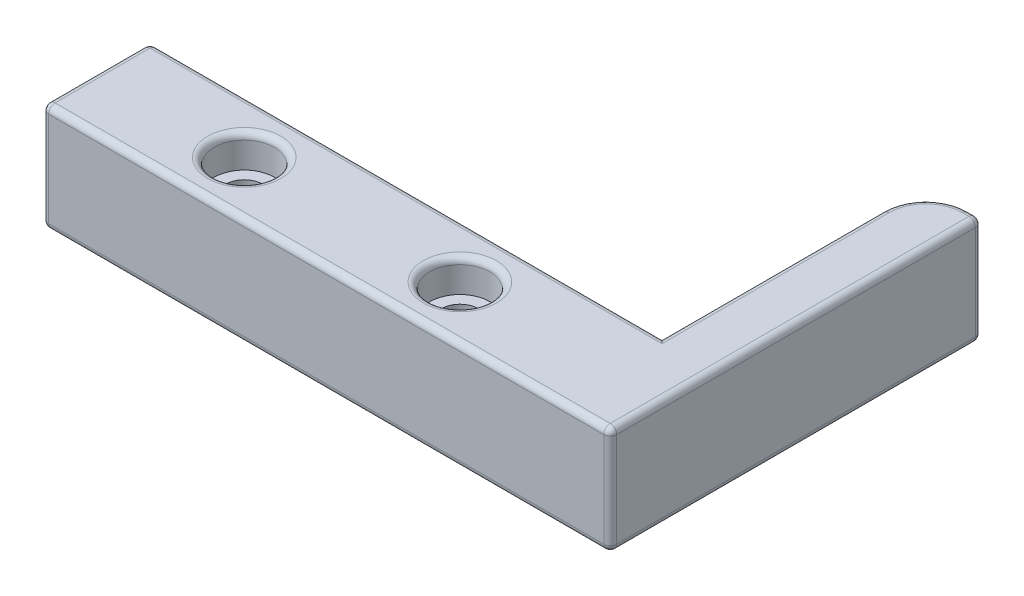
ISO-10303-21;
HEADER;
FILE_DESCRIPTION(('STEP AP214'),'2;1');
FILE_NAME('part.step','',(''),(''),'','','');
FILE_SCHEMA(('AUTOMOTIVE_DESIGN { 1 0 10303 214 1 1 1 1 }'));
ENDSEC;
DATA;
#1=APPLICATION_CONTEXT('core data for automotive mechanical design processes');
#2=APPLICATION_PROTOCOL_DEFINITION('international standard','automotive_design',2000,#1);
#3=PRODUCT_CONTEXT('',#1,'mechanical');
#4=PRODUCT('Part','Part','',(#3));
#5=PRODUCT_RELATED_PRODUCT_CATEGORY('part','',(#4));
#6=PRODUCT_DEFINITION_FORMATION('','',#4);
#7=PRODUCT_DEFINITION_CONTEXT('part definition',#1,'design');
#8=PRODUCT_DEFINITION('design','',#6,#7);
#9=PRODUCT_DEFINITION_SHAPE('','',#8);
#10=(LENGTH_UNIT() NAMED_UNIT(*) SI_UNIT(.MILLI.,.METRE.));
#11=(NAMED_UNIT(*) PLANE_ANGLE_UNIT() SI_UNIT($,.RADIAN.));
#12=(NAMED_UNIT(*) SI_UNIT($,.STERADIAN.) SOLID_ANGLE_UNIT());
#13=UNCERTAINTY_MEASURE_WITH_UNIT(LENGTH_MEASURE(1.E-05),#10,'distance_accuracy_value','');
#14=(GEOMETRIC_REPRESENTATION_CONTEXT(3) GLOBAL_UNCERTAINTY_ASSIGNED_CONTEXT((#13)) GLOBAL_UNIT_ASSIGNED_CONTEXT((#10,
#11,#12)) REPRESENTATION_CONTEXT('',''));
#15=CARTESIAN_POINT('',(0.,0.,0.));
#16=DIRECTION('',(0.,0.,1.));
#17=DIRECTION('',(1.,0.,0.));
#18=AXIS2_PLACEMENT_3D('',#15,#16,#17);
#19=CARTESIAN_POINT('',(42.8625,12.7,-6.35));
#20=DIRECTION('',(0.,-1.,0.));
#21=DIRECTION('',(0.,0.,-1.));
#22=AXIS2_PLACEMENT_3D('',#19,#20,#21);
#23=CYLINDRICAL_SURFACE('',#22,2.159);
#24=CARTESIAN_POINT('',(42.8625,0.,-6.35));
#25=DIRECTION('',(0.,1.,0.));
#26=DIRECTION('',(0.,0.,1.));
#27=AXIS2_PLACEMENT_3D('',#24,#25,#26);
#28=CIRCLE('',#27,2.159);
#29=CARTESIAN_POINT('',(42.8625,0.,-4.191));
#30=VERTEX_POINT('',#29);
#31=EDGE_CURVE('E200',#30,#30,#28,.T.);
#32=ORIENTED_EDGE('',*,*,#31,.F.);
#33=EDGE_LOOP('',(#32));
#34=FACE_BOUND('',#33,.T.);
#35=CARTESIAN_POINT('',(42.8625,8.89,-6.35));
#36=DIRECTION('',(0.,1.,0.));
#37=DIRECTION('',(0.,0.,1.));
#38=AXIS2_PLACEMENT_3D('',#35,#36,#37);
#39=CIRCLE('',#38,2.159);
#40=CARTESIAN_POINT('',(42.8625,8.89,-4.191));
#41=VERTEX_POINT('',#40);
#42=EDGE_CURVE('E203',#41,#41,#39,.T.);
#43=ORIENTED_EDGE('',*,*,#42,.T.);
#44=EDGE_LOOP('',(#43));
#45=FACE_BOUND('',#44,.T.);
#46=ADVANCED_FACE('F33',(#34,#45),#23,.F.);
#47=CARTESIAN_POINT('',(17.4625,12.7,-6.35));
#48=DIRECTION('',(0.,-1.,0.));
#49=DIRECTION('',(0.,0.,-1.));
#50=AXIS2_PLACEMENT_3D('',#47,#48,#49);
#51=CYLINDRICAL_SURFACE('',#50,2.159);
#52=CARTESIAN_POINT('',(17.4625,0.,-6.35));
#53=DIRECTION('',(0.,1.,0.));
#54=DIRECTION('',(0.,0.,1.));
#55=AXIS2_PLACEMENT_3D('',#52,#53,#54);
#56=CIRCLE('',#55,2.159);
#57=CARTESIAN_POINT('',(17.4625,0.,-4.191));
#58=VERTEX_POINT('',#57);
#59=EDGE_CURVE('E371',#58,#58,#56,.T.);
#60=ORIENTED_EDGE('',*,*,#59,.F.);
#61=EDGE_LOOP('',(#60));
#62=FACE_BOUND('',#61,.T.);
#63=CARTESIAN_POINT('',(17.4625,8.89,-6.35));
#64=DIRECTION('',(0.,1.,0.));
#65=DIRECTION('',(0.,0.,1.));
#66=AXIS2_PLACEMENT_3D('',#63,#64,#65);
#67=CIRCLE('',#66,2.159);
#68=CARTESIAN_POINT('',(17.4625,8.89,-4.191));
#69=VERTEX_POINT('',#68);
#70=EDGE_CURVE('E368',#69,#69,#67,.T.);
#71=ORIENTED_EDGE('',*,*,#70,.T.);
#72=EDGE_LOOP('',(#71));
#73=FACE_BOUND('',#72,.T.);
#74=ADVANCED_FACE('F400',(#62,#73),#51,.F.);
#75=CARTESIAN_POINT('',(0.,12.7,0.));
#76=DIRECTION('',(0.,1.,0.));
#77=DIRECTION('',(0.,0.,1.));
#78=AXIS2_PLACEMENT_3D('',#75,#76,#77);
#79=PLANE('',#78);
#80=CARTESIAN_POINT('',(17.4625,12.7,-6.35));
#81=DIRECTION('',(0.,1.,0.));
#82=DIRECTION('',(0.,0.,1.));
#83=AXIS2_PLACEMENT_3D('',#80,#81,#82);
#84=CIRCLE('',#83,4.318);
#85=CARTESIAN_POINT('',(17.4625,12.7,-2.032));
#86=VERTEX_POINT('',#85);
#87=EDGE_CURVE('E238',#86,#86,#84,.F.);
#88=ORIENTED_EDGE('',*,*,#87,.T.);
#89=EDGE_LOOP('',(#88));
#90=FACE_BOUND('',#89,.T.);
#91=CARTESIAN_POINT('',(42.8625,12.7,-6.35));
#92=DIRECTION('',(0.,1.,0.));
#93=DIRECTION('',(0.,0.,1.));
#94=AXIS2_PLACEMENT_3D('',#91,#92,#93);
#95=CIRCLE('',#94,4.31800000000001);
#96=CARTESIAN_POINT('',(42.8625,12.7,-2.03199999999999));
#97=VERTEX_POINT('',#96);
#98=EDGE_CURVE('E235',#97,#97,#95,.F.);
#99=ORIENTED_EDGE('',*,*,#98,.T.);
#100=EDGE_LOOP('',(#99));
#101=FACE_BOUND('',#100,.T.);
#102=DIRECTION('',(-1.,0.,0.));
#103=VECTOR('',#102,1.);
#104=CARTESIAN_POINT('',(0.,12.7,-11.938));
#105=LINE('',#104,#103);
#106=CARTESIAN_POINT('',(61.087,12.7,-11.938));
#107=VERTEX_POINT('',#106);
#108=CARTESIAN_POINT('',(0.762000000000001,12.7,-11.938));
#109=VERTEX_POINT('',#108);
#110=EDGE_CURVE('E222',#107,#109,#105,.T.);
#111=ORIENTED_EDGE('',*,*,#110,.T.);
#112=DIRECTION('',(0.,0.,1.));
#113=VECTOR('',#112,1.);
#114=CARTESIAN_POINT('',(0.762,12.7,0.));
#115=LINE('',#114,#113);
#116=CARTESIAN_POINT('',(0.762,12.7,-0.762));
#117=VERTEX_POINT('',#116);
#118=EDGE_CURVE('E233',#109,#117,#115,.T.);
#119=ORIENTED_EDGE('',*,*,#118,.T.);
#120=DIRECTION('',(1.,0.,0.));
#121=VECTOR('',#120,1.);
#122=CARTESIAN_POINT('',(66.929,12.7,-0.761999999999999));
#123=LINE('',#122,#121);
#124=CARTESIAN_POINT('',(66.167,12.7,-0.761999999999999));
#125=VERTEX_POINT('',#124);
#126=EDGE_CURVE('E231',#117,#125,#123,.T.);
#127=ORIENTED_EDGE('',*,*,#126,.T.);
#128=DIRECTION('',(0.,0.,1.));
#129=VECTOR('',#128,1.);
#130=CARTESIAN_POINT('',(66.167,12.7,0.));
#131=LINE('',#130,#129);
#132=CARTESIAN_POINT('',(66.167,12.7,-43.0132593089877));
#133=VERTEX_POINT('',#132);
#134=EDGE_CURVE('E229',#125,#133,#131,.F.);
#135=ORIENTED_EDGE('',*,*,#134,.T.);
#136=DIRECTION('',(-1.,0.,0.));
#137=VECTOR('',#136,1.);
#138=CARTESIAN_POINT('',(65.405,12.7,-43.0132593089877));
#139=LINE('',#138,#137);
#140=CARTESIAN_POINT('',(65.405,12.7,-43.0132593089877));
#141=VERTEX_POINT('',#140);
#142=EDGE_CURVE('E226',#133,#141,#139,.T.);
#143=ORIENTED_EDGE('',*,*,#142,.T.);
#144=CARTESIAN_POINT('',(65.405,12.7,-38.6952593089877));
#145=DIRECTION('',(0.,1.,0.));
#146=DIRECTION('',(0.,0.,1.));
#147=AXIS2_PLACEMENT_3D('',#144,#145,#146);
#148=CIRCLE('',#147,4.318);
#149=CARTESIAN_POINT('',(61.087,12.7,-38.6952593089877));
#150=VERTEX_POINT('',#149);
#151=EDGE_CURVE('E224',#141,#150,#148,.T.);
#152=ORIENTED_EDGE('',*,*,#151,.T.);
#153=DIRECTION('',(0.,0.,1.));
#154=VECTOR('',#153,1.);
#155=CARTESIAN_POINT('',(61.087,12.7,-12.7));
#156=LINE('',#155,#154);
#157=EDGE_CURVE('E179',#150,#107,#156,.T.);
#158=ORIENTED_EDGE('',*,*,#157,.T.);
#159=EDGE_LOOP('',(#111,#119,#127,#135,#143,#152,#158));
#160=FACE_BOUND('',#159,.T.);
#161=ADVANCED_FACE('F406',(#90,#101,#160),#79,.T.);
#162=CARTESIAN_POINT('',(0.,0.,0.));
#163=DIRECTION('',(0.,1.,0.));
#164=DIRECTION('',(0.,0.,1.));
#165=AXIS2_PLACEMENT_3D('',#162,#163,#164);
#166=PLANE('',#165);
#167=DIRECTION('',(-1.,0.,0.));
#168=VECTOR('',#167,1.);
#169=CARTESIAN_POINT('',(0.,0.,-11.938));
#170=LINE('',#169,#168);
#171=CARTESIAN_POINT('',(0.762000000000001,0.,-11.938));
#172=VERTEX_POINT('',#171);
#173=CARTESIAN_POINT('',(61.087,0.,-11.938));
#174=VERTEX_POINT('',#173);
#175=EDGE_CURVE('E214',#172,#174,#170,.F.);
#176=ORIENTED_EDGE('',*,*,#175,.T.);
#177=DIRECTION('',(0.,0.,-1.));
#178=VECTOR('',#177,1.);
#179=CARTESIAN_POINT('',(61.087,0.,0.));
#180=LINE('',#179,#178);
#181=CARTESIAN_POINT('',(61.087,0.,-38.6952593089877));
#182=VERTEX_POINT('',#181);
#183=EDGE_CURVE('E218',#174,#182,#180,.T.);
#184=ORIENTED_EDGE('',*,*,#183,.T.);
#185=CARTESIAN_POINT('',(65.405,0.,-38.6952593089877));
#186=DIRECTION('',(0.,1.,0.));
#187=DIRECTION('',(0.,0.,1.));
#188=AXIS2_PLACEMENT_3D('',#185,#186,#187);
#189=CIRCLE('',#188,4.318);
#190=CARTESIAN_POINT('',(65.405,0.,-43.0132593089877));
#191=VERTEX_POINT('',#190);
#192=EDGE_CURVE('E216',#182,#191,#189,.F.);
#193=ORIENTED_EDGE('',*,*,#192,.T.);
#194=DIRECTION('',(-1.,0.,0.));
#195=VECTOR('',#194,1.);
#196=CARTESIAN_POINT('',(0.,0.,-43.0132593089877));
#197=LINE('',#196,#195);
#198=CARTESIAN_POINT('',(66.167,0.,-43.0132593089877));
#199=VERTEX_POINT('',#198);
#200=EDGE_CURVE('E165',#191,#199,#197,.F.);
#201=ORIENTED_EDGE('',*,*,#200,.T.);
#202=DIRECTION('',(0.,0.,-1.));
#203=VECTOR('',#202,1.);
#204=CARTESIAN_POINT('',(66.167,0.,0.));
#205=LINE('',#204,#203);
#206=CARTESIAN_POINT('',(66.167,0.,-0.761999999999999));
#207=VERTEX_POINT('',#206);
#208=EDGE_CURVE('E209',#199,#207,#205,.F.);
#209=ORIENTED_EDGE('',*,*,#208,.T.);
#210=DIRECTION('',(1.,0.,0.));
#211=VECTOR('',#210,1.);
#212=CARTESIAN_POINT('',(0.,0.,-0.762));
#213=LINE('',#212,#211);
#214=CARTESIAN_POINT('',(0.762,0.,-0.762));
#215=VERTEX_POINT('',#214);
#216=EDGE_CURVE('E190',#207,#215,#213,.F.);
#217=ORIENTED_EDGE('',*,*,#216,.T.);
#218=DIRECTION('',(0.,0.,1.));
#219=VECTOR('',#218,1.);
#220=CARTESIAN_POINT('',(0.762,0.,0.));
#221=LINE('',#220,#219);
#222=EDGE_CURVE('E211',#215,#172,#221,.F.);
#223=ORIENTED_EDGE('',*,*,#222,.T.);
#224=EDGE_LOOP('',(#176,#184,#193,#201,#209,#217,#223));
#225=FACE_BOUND('',#224,.T.);
#226=ORIENTED_EDGE('',*,*,#31,.T.);
#227=EDGE_LOOP('',(#226));
#228=FACE_BOUND('',#227,.T.);
#229=ORIENTED_EDGE('',*,*,#59,.T.);
#230=EDGE_LOOP('',(#229));
#231=FACE_BOUND('',#230,.T.);
#232=ADVANCED_FACE('F414',(#225,#228,#231),#166,.F.);
#233=CARTESIAN_POINT('',(0.,12.7,-12.7));
#234=DIRECTION('',(1.,0.,0.));
#235=DIRECTION('',(0.,0.,-1.));
#236=AXIS2_PLACEMENT_3D('',#233,#234,#235);
#237=PLANE('',#236);
#238=DIRECTION('',(0.,-1.,0.));
#239=VECTOR('',#238,1.);
#240=CARTESIAN_POINT('',(0.,12.7,-11.938));
#241=LINE('',#240,#239);
#242=CARTESIAN_POINT('',(0.,11.938,-11.938));
#243=VERTEX_POINT('',#242);
#244=CARTESIAN_POINT('',(0.,0.762000000000001,-11.938));
#245=VERTEX_POINT('',#244);
#246=EDGE_CURVE('E258',#243,#245,#241,.T.);
#247=ORIENTED_EDGE('',*,*,#246,.T.);
#248=DIRECTION('',(0.,0.,1.));
#249=VECTOR('',#248,1.);
#250=CARTESIAN_POINT('',(0.,0.762000000000001,-12.7));
#251=LINE('',#250,#249);
#252=CARTESIAN_POINT('',(0.,0.762000000000001,-0.762));
#253=VERTEX_POINT('',#252);
#254=EDGE_CURVE('E262',#245,#253,#251,.T.);
#255=ORIENTED_EDGE('',*,*,#254,.T.);
#256=DIRECTION('',(0.,-1.,0.));
#257=VECTOR('',#256,1.);
#258=CARTESIAN_POINT('',(0.,12.7,-0.762000000000001));
#259=LINE('',#258,#257);
#260=CARTESIAN_POINT('',(0.,11.938,-0.762));
#261=VERTEX_POINT('',#260);
#262=EDGE_CURVE('E260',#253,#261,#259,.F.);
#263=ORIENTED_EDGE('',*,*,#262,.T.);
#264=DIRECTION('',(0.,0.,1.));
#265=VECTOR('',#264,1.);
#266=CARTESIAN_POINT('',(0.,11.938,-12.7));
#267=LINE('',#266,#265);
#268=EDGE_CURVE('E256',#261,#243,#267,.F.);
#269=ORIENTED_EDGE('',*,*,#268,.T.);
#270=EDGE_LOOP('',(#247,#255,#263,#269));
#271=FACE_BOUND('',#270,.T.);
#272=ADVANCED_FACE('F418',(#271),#237,.F.);
#273=CARTESIAN_POINT('',(0.,12.7,0.));
#274=DIRECTION('',(0.,0.,-1.));
#275=DIRECTION('',(-1.,0.,0.));
#276=AXIS2_PLACEMENT_3D('',#273,#274,#275);
#277=PLANE('',#276);
#278=DIRECTION('',(0.,-1.,0.));
#279=VECTOR('',#278,1.);
#280=CARTESIAN_POINT('',(0.762,12.7,0.));
#281=LINE('',#280,#279);
#282=CARTESIAN_POINT('',(0.762,11.938,0.));
#283=VERTEX_POINT('',#282);
#284=CARTESIAN_POINT('',(0.762,0.762000000000001,0.));
#285=VERTEX_POINT('',#284);
#286=EDGE_CURVE('E42',#283,#285,#281,.T.);
#287=ORIENTED_EDGE('',*,*,#286,.T.);
#288=DIRECTION('',(1.,0.,0.));
#289=VECTOR('',#288,1.);
#290=CARTESIAN_POINT('',(0.,0.762000000000001,0.));
#291=LINE('',#290,#289);
#292=CARTESIAN_POINT('',(66.167,0.762000000000001,0.));
#293=VERTEX_POINT('',#292);
#294=EDGE_CURVE('E11',#285,#293,#291,.T.);
#295=ORIENTED_EDGE('',*,*,#294,.T.);
#296=DIRECTION('',(0.,-1.,0.));
#297=VECTOR('',#296,1.);
#298=CARTESIAN_POINT('',(66.167,12.7,0.));
#299=LINE('',#298,#297);
#300=CARTESIAN_POINT('',(66.167,11.938,0.));
#301=VERTEX_POINT('',#300);
#302=EDGE_CURVE('E275',#293,#301,#299,.F.);
#303=ORIENTED_EDGE('',*,*,#302,.T.);
#304=DIRECTION('',(1.,0.,0.));
#305=VECTOR('',#304,1.);
#306=CARTESIAN_POINT('',(0.,11.938,0.));
#307=LINE('',#306,#305);
#308=EDGE_CURVE('E53',#301,#283,#307,.F.);
#309=ORIENTED_EDGE('',*,*,#308,.T.);
#310=EDGE_LOOP('',(#287,#295,#303,#309));
#311=FACE_BOUND('',#310,.T.);
#312=ADVANCED_FACE('F423',(#311),#277,.F.);
#313=CARTESIAN_POINT('',(0.,12.7,-12.7));
#314=DIRECTION('',(0.,0.,1.));
#315=DIRECTION('',(1.,0.,0.));
#316=AXIS2_PLACEMENT_3D('',#313,#314,#315);
#317=PLANE('',#316);
#318=DIRECTION('',(0.,-1.,0.));
#319=VECTOR('',#318,1.);
#320=CARTESIAN_POINT('',(60.325,12.7,-12.7));
#321=LINE('',#320,#319);
#322=CARTESIAN_POINT('',(60.325,11.938,-12.7));
#323=VERTEX_POINT('',#322);
#324=CARTESIAN_POINT('',(60.325,0.762000000000001,-12.7));
#325=VERTEX_POINT('',#324);
#326=EDGE_CURVE('E196',#323,#325,#321,.T.);
#327=ORIENTED_EDGE('',*,*,#326,.T.);
#328=DIRECTION('',(-1.,0.,0.));
#329=VECTOR('',#328,1.);
#330=CARTESIAN_POINT('',(0.,0.762000000000001,-12.7));
#331=LINE('',#330,#329);
#332=CARTESIAN_POINT('',(0.762000000000001,0.762000000000001,-12.7));
#333=VERTEX_POINT('',#332);
#334=EDGE_CURVE('E269',#325,#333,#331,.T.);
#335=ORIENTED_EDGE('',*,*,#334,.T.);
#336=DIRECTION('',(0.,-1.,0.));
#337=VECTOR('',#336,1.);
#338=CARTESIAN_POINT('',(0.762000000000001,12.7,-12.7));
#339=LINE('',#338,#337);
#340=CARTESIAN_POINT('',(0.762000000000001,11.938,-12.7));
#341=VERTEX_POINT('',#340);
#342=EDGE_CURVE('E267',#333,#341,#339,.F.);
#343=ORIENTED_EDGE('',*,*,#342,.T.);
#344=DIRECTION('',(-1.,0.,0.));
#345=VECTOR('',#344,1.);
#346=CARTESIAN_POINT('',(60.325,11.938,-12.7));
#347=LINE('',#346,#345);
#348=EDGE_CURVE('E265',#341,#323,#347,.F.);
#349=ORIENTED_EDGE('',*,*,#348,.T.);
#350=EDGE_LOOP('',(#327,#335,#343,#349));
#351=FACE_BOUND('',#350,.T.);
#352=ADVANCED_FACE('F420',(#351),#317,.F.);
#353=CARTESIAN_POINT('',(66.929,12.7,-43.7752593089877));
#354=DIRECTION('',(0.,0.,1.));
#355=DIRECTION('',(1.,0.,0.));
#356=AXIS2_PLACEMENT_3D('',#353,#354,#355);
#357=PLANE('',#356);
#358=DIRECTION('',(0.,1.,0.));
#359=VECTOR('',#358,1.);
#360=CARTESIAN_POINT('',(66.167,0.,-43.7752593089877));
#361=LINE('',#360,#359);
#362=CARTESIAN_POINT('',(66.167,11.938,-43.7752593089877));
#363=VERTEX_POINT('',#362);
#364=CARTESIAN_POINT('',(66.167,0.762000000000001,-43.7752593089877));
#365=VERTEX_POINT('',#364);
#366=EDGE_CURVE('E188',#363,#365,#361,.F.);
#367=ORIENTED_EDGE('',*,*,#366,.T.);
#368=DIRECTION('',(-1.,0.,0.));
#369=VECTOR('',#368,1.);
#370=CARTESIAN_POINT('',(66.929,0.762000000000001,-43.7752593089877));
#371=LINE('',#370,#369);
#372=CARTESIAN_POINT('',(65.405,0.762000000000001,-43.7752593089877));
#373=VERTEX_POINT('',#372);
#374=EDGE_CURVE('E163',#365,#373,#371,.T.);
#375=ORIENTED_EDGE('',*,*,#374,.T.);
#376=DIRECTION('',(0.,1.,0.));
#377=VECTOR('',#376,1.);
#378=CARTESIAN_POINT('',(65.405,12.7,-43.7752593089877));
#379=LINE('',#378,#377);
#380=CARTESIAN_POINT('',(65.405,11.938,-43.7752593089877));
#381=VERTEX_POINT('',#380);
#382=EDGE_CURVE('E185',#373,#381,#379,.T.);
#383=ORIENTED_EDGE('',*,*,#382,.T.);
#384=DIRECTION('',(-1.,0.,0.));
#385=VECTOR('',#384,1.);
#386=CARTESIAN_POINT('',(66.929,11.938,-43.7752593089877));
#387=LINE('',#386,#385);
#388=EDGE_CURVE('E191',#381,#363,#387,.F.);
#389=ORIENTED_EDGE('',*,*,#388,.T.);
#390=EDGE_LOOP('',(#367,#375,#383,#389));
#391=FACE_BOUND('',#390,.T.);
#392=ADVANCED_FACE('F184',(#391),#357,.F.);
#393=CARTESIAN_POINT('',(66.929,0.,0.));
#394=DIRECTION('',(1.,0.,0.));
#395=DIRECTION('',(0.,0.,-1.));
#396=AXIS2_PLACEMENT_3D('',#393,#394,#395);
#397=PLANE('',#396);
#398=DIRECTION('',(0.,0.,-1.));
#399=VECTOR('',#398,1.);
#400=CARTESIAN_POINT('',(66.929,0.762,-43.7752593089877));
#401=LINE('',#400,#399);
#402=CARTESIAN_POINT('',(66.929,0.762,-0.761999999999999));
#403=VERTEX_POINT('',#402);
#404=CARTESIAN_POINT('',(66.929,0.762,-43.0132593089877));
#405=VERTEX_POINT('',#404);
#406=EDGE_CURVE('E251',#403,#405,#401,.T.);
#407=ORIENTED_EDGE('',*,*,#406,.T.);
#408=DIRECTION('',(0.,1.,0.));
#409=VECTOR('',#408,1.);
#410=CARTESIAN_POINT('',(66.929,12.7,-43.0132593089877));
#411=LINE('',#410,#409);
#412=CARTESIAN_POINT('',(66.929,11.938,-43.0132593089877));
#413=VERTEX_POINT('',#412);
#414=EDGE_CURVE('E253',#405,#413,#411,.T.);
#415=ORIENTED_EDGE('',*,*,#414,.T.);
#416=DIRECTION('',(0.,0.,1.));
#417=VECTOR('',#416,1.);
#418=CARTESIAN_POINT('',(66.929,11.938,0.));
#419=LINE('',#418,#417);
#420=CARTESIAN_POINT('',(66.929,11.938,-0.761999999999999));
#421=VERTEX_POINT('',#420);
#422=EDGE_CURVE('E249',#413,#421,#419,.T.);
#423=ORIENTED_EDGE('',*,*,#422,.T.);
#424=DIRECTION('',(0.,-1.,0.));
#425=VECTOR('',#424,1.);
#426=CARTESIAN_POINT('',(66.929,0.,-0.761999999999999));
#427=LINE('',#426,#425);
#428=EDGE_CURVE('E247',#421,#403,#427,.T.);
#429=ORIENTED_EDGE('',*,*,#428,.T.);
#430=EDGE_LOOP('',(#407,#415,#423,#429));
#431=FACE_BOUND('',#430,.T.);
#432=ADVANCED_FACE('F547',(#431),#397,.T.);
#433=CARTESIAN_POINT('',(60.325,0.,0.));
#434=DIRECTION('',(1.,0.,0.));
#435=DIRECTION('',(0.,0.,-1.));
#436=AXIS2_PLACEMENT_3D('',#433,#434,#435);
#437=PLANE('',#436);
#438=DIRECTION('',(0.,1.,0.));
#439=VECTOR('',#438,1.);
#440=CARTESIAN_POINT('',(60.325,0.,-38.6952593089877));
#441=LINE('',#440,#439);
#442=CARTESIAN_POINT('',(60.325,11.938,-38.6952593089877));
#443=VERTEX_POINT('',#442);
#444=CARTESIAN_POINT('',(60.325,0.762,-38.6952593089877));
#445=VERTEX_POINT('',#444);
#446=EDGE_CURVE('E195',#443,#445,#441,.F.);
#447=ORIENTED_EDGE('',*,*,#446,.T.);
#448=DIRECTION('',(0.,0.,-1.));
#449=VECTOR('',#448,1.);
#450=CARTESIAN_POINT('',(60.325,0.762,0.));
#451=LINE('',#450,#449);
#452=EDGE_CURVE('E273',#445,#325,#451,.F.);
#453=ORIENTED_EDGE('',*,*,#452,.T.);
#454=ORIENTED_EDGE('',*,*,#326,.F.);
#455=DIRECTION('',(0.,0.,1.));
#456=VECTOR('',#455,1.);
#457=CARTESIAN_POINT('',(60.325,11.938,-38.6952593089877));
#458=LINE('',#457,#456);
#459=EDGE_CURVE('E271',#323,#443,#458,.F.);
#460=ORIENTED_EDGE('',*,*,#459,.T.);
#461=EDGE_LOOP('',(#447,#453,#454,#460));
#462=FACE_BOUND('',#461,.T.);
#463=ADVANCED_FACE('F542',(#462),#437,.F.);
#464=CARTESIAN_POINT('',(17.4625,8.89,-6.35));
#465=DIRECTION('',(0.,1.,0.));
#466=DIRECTION('',(0.,0.,1.));
#467=AXIS2_PLACEMENT_3D('',#464,#465,#466);
#468=CYLINDRICAL_SURFACE('',#467,3.556);
#469=CARTESIAN_POINT('',(17.4625,11.938,-6.35));
#470=DIRECTION('',(0.,1.,0.));
#471=DIRECTION('',(0.,0.,1.));
#472=AXIS2_PLACEMENT_3D('',#469,#470,#471);
#473=CIRCLE('',#472,3.556);
#474=CARTESIAN_POINT('',(17.4625,11.938,-2.794));
#475=VERTEX_POINT('',#474);
#476=EDGE_CURVE('E241',#475,#475,#473,.T.);
#477=ORIENTED_EDGE('',*,*,#476,.T.);
#478=EDGE_LOOP('',(#477));
#479=FACE_BOUND('',#478,.T.);
#480=CARTESIAN_POINT('',(17.4625,8.89,-6.35));
#481=DIRECTION('',(0.,1.,0.));
#482=DIRECTION('',(0.,0.,1.));
#483=AXIS2_PLACEMENT_3D('',#480,#481,#482);
#484=CIRCLE('',#483,3.556);
#485=CARTESIAN_POINT('',(17.4625,8.89,-2.794));
#486=VERTEX_POINT('',#485);
#487=EDGE_CURVE('E357',#486,#486,#484,.T.);
#488=ORIENTED_EDGE('',*,*,#487,.F.);
#489=EDGE_LOOP('',(#488));
#490=FACE_BOUND('',#489,.T.);
#491=ADVANCED_FACE('F396',(#479,#490),#468,.F.);
#492=CARTESIAN_POINT('',(17.4625,8.89,-6.35));
#493=DIRECTION('',(0.,1.,0.));
#494=DIRECTION('',(0.,0.,1.));
#495=AXIS2_PLACEMENT_3D('',#492,#493,#494);
#496=PLANE('',#495);
#497=ORIENTED_EDGE('',*,*,#70,.F.);
#498=EDGE_LOOP('',(#497));
#499=FACE_BOUND('',#498,.T.);
#500=ORIENTED_EDGE('',*,*,#487,.T.);
#501=EDGE_LOOP('',(#500));
#502=FACE_BOUND('',#501,.T.);
#503=ADVANCED_FACE('F390',(#499,#502),#496,.T.);
#504=CARTESIAN_POINT('',(42.8625,8.89,-6.35));
#505=DIRECTION('',(0.,1.,0.));
#506=DIRECTION('',(0.,0.,1.));
#507=AXIS2_PLACEMENT_3D('',#504,#505,#506);
#508=CYLINDRICAL_SURFACE('',#507,3.55600000000001);
#509=CARTESIAN_POINT('',(42.8625,11.938,-6.35));
#510=DIRECTION('',(0.,1.,0.));
#511=DIRECTION('',(0.,0.,1.));
#512=AXIS2_PLACEMENT_3D('',#509,#510,#511);
#513=CIRCLE('',#512,3.55600000000001);
#514=CARTESIAN_POINT('',(42.8625,11.938,-2.79399999999999));
#515=VERTEX_POINT('',#514);
#516=EDGE_CURVE('E244',#515,#515,#513,.T.);
#517=ORIENTED_EDGE('',*,*,#516,.T.);
#518=EDGE_LOOP('',(#517));
#519=FACE_BOUND('',#518,.T.);
#520=CARTESIAN_POINT('',(42.8625,8.89,-6.35));
#521=DIRECTION('',(0.,1.,0.));
#522=DIRECTION('',(0.,0.,1.));
#523=AXIS2_PLACEMENT_3D('',#520,#521,#522);
#524=CIRCLE('',#523,3.55600000000001);
#525=CARTESIAN_POINT('',(42.8625,8.89,-2.79399999999999));
#526=VERTEX_POINT('',#525);
#527=EDGE_CURVE('E363',#526,#526,#524,.T.);
#528=ORIENTED_EDGE('',*,*,#527,.F.);
#529=EDGE_LOOP('',(#528));
#530=FACE_BOUND('',#529,.T.);
#531=ADVANCED_FACE('F385',(#519,#530),#508,.F.);
#532=CARTESIAN_POINT('',(42.8625,8.89,-6.35));
#533=DIRECTION('',(0.,1.,0.));
#534=DIRECTION('',(0.,0.,1.));
#535=AXIS2_PLACEMENT_3D('',#532,#533,#534);
#536=PLANE('',#535);
#537=ORIENTED_EDGE('',*,*,#42,.F.);
#538=EDGE_LOOP('',(#537));
#539=FACE_BOUND('',#538,.T.);
#540=ORIENTED_EDGE('',*,*,#527,.T.);
#541=EDGE_LOOP('',(#540));
#542=FACE_BOUND('',#541,.T.);
#543=ADVANCED_FACE('F382',(#539,#542),#536,.T.);
#544=CARTESIAN_POINT('',(65.405,12.7,-38.6952593089877));
#545=DIRECTION('',(0.,1.,0.));
#546=DIRECTION('',(0.,0.,1.));
#547=AXIS2_PLACEMENT_3D('',#544,#545,#546);
#548=CYLINDRICAL_SURFACE('',#547,5.08);
#549=ORIENTED_EDGE('',*,*,#382,.F.);
#550=CARTESIAN_POINT('',(65.405,0.762000000000001,-38.6952593089877));
#551=DIRECTION('',(0.,1.,0.));
#552=DIRECTION('',(0.,0.,1.));
#553=AXIS2_PLACEMENT_3D('',#550,#551,#552);
#554=CIRCLE('',#553,5.08);
#555=EDGE_CURVE('E171',#373,#445,#554,.T.);
#556=ORIENTED_EDGE('',*,*,#555,.T.);
#557=ORIENTED_EDGE('',*,*,#446,.F.);
#558=CARTESIAN_POINT('',(65.405,11.938,-38.6952593089877));
#559=DIRECTION('',(0.,1.,0.));
#560=DIRECTION('',(0.,0.,1.));
#561=AXIS2_PLACEMENT_3D('',#558,#559,#560);
#562=CIRCLE('',#561,5.08);
#563=EDGE_CURVE('E180',#443,#381,#562,.F.);
#564=ORIENTED_EDGE('',*,*,#563,.T.);
#565=EDGE_LOOP('',(#549,#556,#557,#564));
#566=FACE_BOUND('',#565,.T.);
#567=ADVANCED_FACE('F193',(#566),#548,.T.);
#568=CARTESIAN_POINT('',(0.762,11.938,-0.762));
#569=DIRECTION('',(0.,0.,1.));
#570=DIRECTION('',(1.,0.,0.));
#571=AXIS2_PLACEMENT_3D('',#568,#569,#570);
#572=SPHERICAL_SURFACE('',#571,0.762);
#573=CARTESIAN_POINT('',(0.762,11.938,-0.762));
#574=DIRECTION('',(-1.,0.,0.));
#575=DIRECTION('',(0.,0.,1.));
#576=AXIS2_PLACEMENT_3D('',#573,#574,#575);
#577=CIRCLE('',#576,0.762);
#578=EDGE_CURVE('E349',#117,#283,#577,.F.);
#579=ORIENTED_EDGE('',*,*,#578,.F.);
#580=CARTESIAN_POINT('',(0.762,11.938,-0.762));
#581=DIRECTION('',(0.,0.,1.));
#582=DIRECTION('',(1.,0.,0.));
#583=AXIS2_PLACEMENT_3D('',#580,#581,#582);
#584=CIRCLE('',#583,0.762);
#585=EDGE_CURVE('E37',#261,#117,#584,.F.);
#586=ORIENTED_EDGE('',*,*,#585,.F.);
#587=CARTESIAN_POINT('',(0.762,11.938,-0.762));
#588=DIRECTION('',(0.,1.,0.));
#589=DIRECTION('',(0.,0.,1.));
#590=AXIS2_PLACEMENT_3D('',#587,#588,#589);
#591=CIRCLE('',#590,0.762);
#592=EDGE_CURVE('E350',#283,#261,#591,.F.);
#593=ORIENTED_EDGE('',*,*,#592,.F.);
#594=EDGE_LOOP('',(#579,#586,#593));
#595=FACE_BOUND('',#594,.T.);
#596=ADVANCED_FACE('F432',(#595),#572,.T.);
#597=CARTESIAN_POINT('',(0.,11.938,-11.938));
#598=DIRECTION('',(1.,0.,0.));
#599=DIRECTION('',(0.,0.,-1.));
#600=AXIS2_PLACEMENT_3D('',#597,#598,#599);
#601=CYLINDRICAL_SURFACE('',#600,0.762);
#602=CARTESIAN_POINT('',(0.762000000000001,11.938,-11.938));
#603=DIRECTION('',(-1.,0.,0.));
#604=DIRECTION('',(0.,0.,1.));
#605=AXIS2_PLACEMENT_3D('',#602,#603,#604);
#606=CIRCLE('',#605,0.762);
#607=EDGE_CURVE('E343',#109,#341,#606,.T.);
#608=ORIENTED_EDGE('',*,*,#607,.F.);
#609=ORIENTED_EDGE('',*,*,#110,.F.);
#610=CARTESIAN_POINT('',(61.087,11.938,-11.938));
#611=DIRECTION('',(0.707106781186547,0.,-0.707106781186547));
#612=DIRECTION('',(0.707106781186547,0.,0.707106781186547));
#613=AXIS2_PLACEMENT_3D('',#610,#611,#612);
#614=ELLIPSE('',#613,1.0776307345283,0.762);
#615=EDGE_CURVE('E346',#323,#107,#614,.T.);
#616=ORIENTED_EDGE('',*,*,#615,.F.);
#617=ORIENTED_EDGE('',*,*,#348,.F.);
#618=EDGE_LOOP('',(#608,#609,#616,#617));
#619=FACE_BOUND('',#618,.T.);
#620=ADVANCED_FACE('F524',(#619),#601,.T.);
#621=CARTESIAN_POINT('',(0.762,11.938,0.));
#622=DIRECTION('',(0.,0.,-1.));
#623=DIRECTION('',(-1.,0.,0.));
#624=AXIS2_PLACEMENT_3D('',#621,#622,#623);
#625=CYLINDRICAL_SURFACE('',#624,0.762);
#626=ORIENTED_EDGE('',*,*,#585,.T.);
#627=ORIENTED_EDGE('',*,*,#118,.F.);
#628=CARTESIAN_POINT('',(0.762000000000001,11.938,-11.938));
#629=DIRECTION('',(0.,0.,-1.));
#630=DIRECTION('',(-1.,0.,0.));
#631=AXIS2_PLACEMENT_3D('',#628,#629,#630);
#632=CIRCLE('',#631,0.762);
#633=EDGE_CURVE('E340',#243,#109,#632,.T.);
#634=ORIENTED_EDGE('',*,*,#633,.F.);
#635=ORIENTED_EDGE('',*,*,#268,.F.);
#636=EDGE_LOOP('',(#626,#627,#634,#635));
#637=FACE_BOUND('',#636,.T.);
#638=ADVANCED_FACE('F521',(#637),#625,.T.);
#639=CARTESIAN_POINT('',(0.762,12.7,-0.762));
#640=DIRECTION('',(0.,-1.,0.));
#641=DIRECTION('',(0.,0.,-1.));
#642=AXIS2_PLACEMENT_3D('',#639,#640,#641);
#643=CYLINDRICAL_SURFACE('',#642,0.762);
#644=ORIENTED_EDGE('',*,*,#592,.T.);
#645=ORIENTED_EDGE('',*,*,#262,.F.);
#646=CARTESIAN_POINT('',(0.762,0.762000000000001,-0.762));
#647=DIRECTION('',(0.,-1.,0.));
#648=DIRECTION('',(0.,0.,-1.));
#649=AXIS2_PLACEMENT_3D('',#646,#647,#648);
#650=CIRCLE('',#649,0.762);
#651=EDGE_CURVE('E337',#285,#253,#650,.T.);
#652=ORIENTED_EDGE('',*,*,#651,.F.);
#653=ORIENTED_EDGE('',*,*,#286,.F.);
#654=EDGE_LOOP('',(#644,#645,#652,#653));
#655=FACE_BOUND('',#654,.T.);
#656=ADVANCED_FACE('F517',(#655),#643,.T.);
#657=CARTESIAN_POINT('',(0.,11.938,-0.762));
#658=DIRECTION('',(-1.,0.,0.));
#659=DIRECTION('',(0.,0.,1.));
#660=AXIS2_PLACEMENT_3D('',#657,#658,#659);
#661=CYLINDRICAL_SURFACE('',#660,0.762);
#662=ORIENTED_EDGE('',*,*,#578,.T.);
#663=ORIENTED_EDGE('',*,*,#308,.F.);
#664=CARTESIAN_POINT('',(66.167,11.938,-0.761999999999999));
#665=DIRECTION('',(1.,0.,0.));
#666=DIRECTION('',(0.,0.,-1.));
#667=AXIS2_PLACEMENT_3D('',#664,#665,#666);
#668=CIRCLE('',#667,0.762);
#669=EDGE_CURVE('E334',#125,#301,#668,.T.);
#670=ORIENTED_EDGE('',*,*,#669,.F.);
#671=ORIENTED_EDGE('',*,*,#126,.F.);
#672=EDGE_LOOP('',(#662,#663,#670,#671));
#673=FACE_BOUND('',#672,.T.);
#674=ADVANCED_FACE('F513',(#673),#661,.T.);
#675=CARTESIAN_POINT('',(61.087,11.938,0.));
#676=DIRECTION('',(0.,0.,-1.));
#677=DIRECTION('',(-1.,0.,0.));
#678=AXIS2_PLACEMENT_3D('',#675,#676,#677);
#679=CYLINDRICAL_SURFACE('',#678,0.762);
#680=ORIENTED_EDGE('',*,*,#615,.T.);
#681=ORIENTED_EDGE('',*,*,#157,.F.);
#682=CARTESIAN_POINT('',(61.087,11.938,-38.6952593089877));
#683=DIRECTION('',(0.,0.,-1.));
#684=DIRECTION('',(-1.,0.,0.));
#685=AXIS2_PLACEMENT_3D('',#682,#683,#684);
#686=CIRCLE('',#685,0.762);
#687=EDGE_CURVE('E331',#443,#150,#686,.T.);
#688=ORIENTED_EDGE('',*,*,#687,.F.);
#689=ORIENTED_EDGE('',*,*,#459,.F.);
#690=EDGE_LOOP('',(#680,#681,#688,#689));
#691=FACE_BOUND('',#690,.T.);
#692=ADVANCED_FACE('F509',(#691),#679,.T.);
#693=CARTESIAN_POINT('',(0.762000000000001,11.938,-11.938));
#694=DIRECTION('',(0.,0.,1.));
#695=DIRECTION('',(1.,0.,0.));
#696=AXIS2_PLACEMENT_3D('',#693,#694,#695);
#697=SPHERICAL_SURFACE('',#696,0.762);
#698=ORIENTED_EDGE('',*,*,#633,.T.);
#699=ORIENTED_EDGE('',*,*,#607,.T.);
#700=CARTESIAN_POINT('',(0.762000000000001,11.938,-11.938));
#701=DIRECTION('',(0.,1.,0.));
#702=DIRECTION('',(0.,0.,1.));
#703=AXIS2_PLACEMENT_3D('',#700,#701,#702);
#704=CIRCLE('',#703,0.762);
#705=EDGE_CURVE('E328',#243,#341,#704,.F.);
#706=ORIENTED_EDGE('',*,*,#705,.F.);
#707=EDGE_LOOP('',(#698,#699,#706));
#708=FACE_BOUND('',#707,.T.);
#709=ADVANCED_FACE('F505',(#708),#697,.T.);
#710=CARTESIAN_POINT('',(0.762,0.762,-0.762));
#711=DIRECTION('',(0.,0.,1.));
#712=DIRECTION('',(1.,0.,0.));
#713=AXIS2_PLACEMENT_3D('',#710,#711,#712);
#714=SPHERICAL_SURFACE('',#713,0.762);
#715=CARTESIAN_POINT('',(0.762,0.762,-0.762));
#716=DIRECTION('',(-1.,0.,0.));
#717=DIRECTION('',(0.,0.,1.));
#718=AXIS2_PLACEMENT_3D('',#715,#716,#717);
#719=CIRCLE('',#718,0.762);
#720=EDGE_CURVE('E323',#285,#215,#719,.F.);
#721=ORIENTED_EDGE('',*,*,#720,.F.);
#722=ORIENTED_EDGE('',*,*,#651,.T.);
#723=CARTESIAN_POINT('',(0.762,0.762000000000001,-0.762));
#724=DIRECTION('',(0.,0.,1.));
#725=DIRECTION('',(1.,0.,0.));
#726=AXIS2_PLACEMENT_3D('',#723,#724,#725);
#727=CIRCLE('',#726,0.762);
#728=EDGE_CURVE('E326',#215,#253,#727,.F.);
#729=ORIENTED_EDGE('',*,*,#728,.F.);
#730=EDGE_LOOP('',(#721,#722,#729));
#731=FACE_BOUND('',#730,.T.);
#732=ADVANCED_FACE('F501',(#731),#714,.T.);
#733=CARTESIAN_POINT('',(66.167,11.938,-0.761999999999999));
#734=DIRECTION('',(0.,0.,1.));
#735=DIRECTION('',(1.,0.,0.));
#736=AXIS2_PLACEMENT_3D('',#733,#734,#735);
#737=SPHERICAL_SURFACE('',#736,0.762);
#738=CARTESIAN_POINT('',(66.167,11.938,-0.761999999999999));
#739=DIRECTION('',(0.,0.,1.));
#740=DIRECTION('',(1.,0.,0.));
#741=AXIS2_PLACEMENT_3D('',#738,#739,#740);
#742=CIRCLE('',#741,0.762);
#743=EDGE_CURVE('E317',#125,#421,#742,.F.);
#744=ORIENTED_EDGE('',*,*,#743,.F.);
#745=ORIENTED_EDGE('',*,*,#669,.T.);
#746=CARTESIAN_POINT('',(66.167,11.938,-0.761999999999999));
#747=DIRECTION('',(0.,1.,0.));
#748=DIRECTION('',(0.,0.,1.));
#749=AXIS2_PLACEMENT_3D('',#746,#747,#748);
#750=CIRCLE('',#749,0.762);
#751=EDGE_CURVE('E320',#421,#301,#750,.F.);
#752=ORIENTED_EDGE('',*,*,#751,.F.);
#753=EDGE_LOOP('',(#744,#745,#752));
#754=FACE_BOUND('',#753,.T.);
#755=ADVANCED_FACE('F497',(#754),#737,.T.);
#756=CARTESIAN_POINT('',(65.405,11.938,-38.6952593089877));
#757=DIRECTION('',(0.,1.,0.));
#758=DIRECTION('',(0.,0.,1.));
#759=AXIS2_PLACEMENT_3D('',#756,#757,#758);
#760=TOROIDAL_SURFACE('',#759,4.318,0.762);
#761=ORIENTED_EDGE('',*,*,#687,.T.);
#762=ORIENTED_EDGE('',*,*,#151,.F.);
#763=CARTESIAN_POINT('',(65.405,11.938,-43.0132593089877));
#764=DIRECTION('',(1.,0.,0.));
#765=DIRECTION('',(0.,0.,-1.));
#766=AXIS2_PLACEMENT_3D('',#763,#764,#765);
#767=CIRCLE('',#766,0.762);
#768=EDGE_CURVE('E315',#381,#141,#767,.T.);
#769=ORIENTED_EDGE('',*,*,#768,.F.);
#770=ORIENTED_EDGE('',*,*,#563,.F.);
#771=EDGE_LOOP('',(#761,#762,#769,#770));
#772=FACE_BOUND('',#771,.T.);
#773=ADVANCED_FACE('F493',(#772),#760,.T.);
#774=CARTESIAN_POINT('',(0.762000000000001,12.7,-11.938));
#775=DIRECTION('',(0.,-1.,0.));
#776=DIRECTION('',(0.,0.,-1.));
#777=AXIS2_PLACEMENT_3D('',#774,#775,#776);
#778=CYLINDRICAL_SURFACE('',#777,0.762);
#779=ORIENTED_EDGE('',*,*,#705,.T.);
#780=ORIENTED_EDGE('',*,*,#342,.F.);
#781=CARTESIAN_POINT('',(0.762000000000001,0.762000000000001,-11.938));
#782=DIRECTION('',(0.,-1.,0.));
#783=DIRECTION('',(0.,0.,-1.));
#784=AXIS2_PLACEMENT_3D('',#781,#782,#783);
#785=CIRCLE('',#784,0.762);
#786=EDGE_CURVE('E312',#245,#333,#785,.T.);
#787=ORIENTED_EDGE('',*,*,#786,.F.);
#788=ORIENTED_EDGE('',*,*,#246,.F.);
#789=EDGE_LOOP('',(#779,#780,#787,#788));
#790=FACE_BOUND('',#789,.T.);
#791=ADVANCED_FACE('F489',(#790),#778,.T.);
#792=CARTESIAN_POINT('',(0.762000000000001,0.762000000000001,-12.7));
#793=DIRECTION('',(0.,0.,1.));
#794=DIRECTION('',(1.,0.,0.));
#795=AXIS2_PLACEMENT_3D('',#792,#793,#794);
#796=CYLINDRICAL_SURFACE('',#795,0.762);
#797=ORIENTED_EDGE('',*,*,#728,.T.);
#798=ORIENTED_EDGE('',*,*,#254,.F.);
#799=CARTESIAN_POINT('',(0.762000000000001,0.762,-11.938));
#800=DIRECTION('',(0.,0.,-1.));
#801=DIRECTION('',(-1.,0.,0.));
#802=AXIS2_PLACEMENT_3D('',#799,#800,#801);
#803=CIRCLE('',#802,0.762);
#804=EDGE_CURVE('E309',#172,#245,#803,.T.);
#805=ORIENTED_EDGE('',*,*,#804,.F.);
#806=ORIENTED_EDGE('',*,*,#222,.F.);
#807=EDGE_LOOP('',(#797,#798,#805,#806));
#808=FACE_BOUND('',#807,.T.);
#809=ADVANCED_FACE('F485',(#808),#796,.T.);
#810=CARTESIAN_POINT('',(0.,0.762000000000001,-0.762));
#811=DIRECTION('',(1.,0.,0.));
#812=DIRECTION('',(0.,0.,-1.));
#813=AXIS2_PLACEMENT_3D('',#810,#811,#812);
#814=CYLINDRICAL_SURFACE('',#813,0.762);
#815=ORIENTED_EDGE('',*,*,#720,.T.);
#816=ORIENTED_EDGE('',*,*,#216,.F.);
#817=CARTESIAN_POINT('',(66.167,0.762000000000001,-0.761999999999999));
#818=DIRECTION('',(1.,0.,0.));
#819=DIRECTION('',(0.,0.,-1.));
#820=AXIS2_PLACEMENT_3D('',#817,#818,#819);
#821=CIRCLE('',#820,0.762);
#822=EDGE_CURVE('E306',#293,#207,#821,.T.);
#823=ORIENTED_EDGE('',*,*,#822,.F.);
#824=ORIENTED_EDGE('',*,*,#294,.F.);
#825=EDGE_LOOP('',(#815,#816,#823,#824));
#826=FACE_BOUND('',#825,.T.);
#827=ADVANCED_FACE('F481',(#826),#814,.T.);
#828=CARTESIAN_POINT('',(66.167,0.,-0.761999999999999));
#829=DIRECTION('',(0.,1.,0.));
#830=DIRECTION('',(0.,0.,1.));
#831=AXIS2_PLACEMENT_3D('',#828,#829,#830);
#832=CYLINDRICAL_SURFACE('',#831,0.762);
#833=ORIENTED_EDGE('',*,*,#751,.T.);
#834=ORIENTED_EDGE('',*,*,#302,.F.);
#835=CARTESIAN_POINT('',(66.167,0.762,-0.761999999999999));
#836=DIRECTION('',(0.,-1.,0.));
#837=DIRECTION('',(0.,0.,-1.));
#838=AXIS2_PLACEMENT_3D('',#835,#836,#837);
#839=CIRCLE('',#838,0.762);
#840=EDGE_CURVE('E304',#403,#293,#839,.T.);
#841=ORIENTED_EDGE('',*,*,#840,.F.);
#842=ORIENTED_EDGE('',*,*,#428,.F.);
#843=EDGE_LOOP('',(#833,#834,#841,#842));
#844=FACE_BOUND('',#843,.T.);
#845=ADVANCED_FACE('F477',(#844),#832,.T.);
#846=CARTESIAN_POINT('',(66.167,11.938,0.));
#847=DIRECTION('',(0.,0.,1.));
#848=DIRECTION('',(1.,0.,0.));
#849=AXIS2_PLACEMENT_3D('',#846,#847,#848);
#850=CYLINDRICAL_SURFACE('',#849,0.762);
#851=ORIENTED_EDGE('',*,*,#743,.T.);
#852=ORIENTED_EDGE('',*,*,#422,.F.);
#853=CARTESIAN_POINT('',(66.167,11.938,-43.0132593089877));
#854=DIRECTION('',(0.,0.,-1.));
#855=DIRECTION('',(-1.,0.,0.));
#856=AXIS2_PLACEMENT_3D('',#853,#854,#855);
#857=CIRCLE('',#856,0.762);
#858=EDGE_CURVE('E301',#133,#413,#857,.T.);
#859=ORIENTED_EDGE('',*,*,#858,.F.);
#860=ORIENTED_EDGE('',*,*,#134,.F.);
#861=EDGE_LOOP('',(#851,#852,#859,#860));
#862=FACE_BOUND('',#861,.T.);
#863=ADVANCED_FACE('F473',(#862),#850,.T.);
#864=CARTESIAN_POINT('',(0.,11.938,-43.0132593089877));
#865=DIRECTION('',(1.,0.,0.));
#866=DIRECTION('',(0.,0.,-1.));
#867=AXIS2_PLACEMENT_3D('',#864,#865,#866);
#868=CYLINDRICAL_SURFACE('',#867,0.762);
#869=ORIENTED_EDGE('',*,*,#768,.T.);
#870=ORIENTED_EDGE('',*,*,#142,.F.);
#871=CARTESIAN_POINT('',(66.167,11.938,-43.0132593089877));
#872=DIRECTION('',(1.,0.,0.));
#873=DIRECTION('',(0.,0.,-1.));
#874=AXIS2_PLACEMENT_3D('',#871,#872,#873);
#875=CIRCLE('',#874,0.762);
#876=EDGE_CURVE('E298',#363,#133,#875,.T.);
#877=ORIENTED_EDGE('',*,*,#876,.F.);
#878=ORIENTED_EDGE('',*,*,#388,.F.);
#879=EDGE_LOOP('',(#869,#870,#877,#878));
#880=FACE_BOUND('',#879,.T.);
#881=ADVANCED_FACE('F469',(#880),#868,.T.);
#882=CARTESIAN_POINT('',(0.762000000000001,0.762,-11.938));
#883=DIRECTION('',(0.,0.,1.));
#884=DIRECTION('',(1.,0.,0.));
#885=AXIS2_PLACEMENT_3D('',#882,#883,#884);
#886=SPHERICAL_SURFACE('',#885,0.762);
#887=ORIENTED_EDGE('',*,*,#804,.T.);
#888=ORIENTED_EDGE('',*,*,#786,.T.);
#889=CARTESIAN_POINT('',(0.762000000000001,0.762000000000001,-11.938));
#890=DIRECTION('',(-1.,0.,0.));
#891=DIRECTION('',(0.,0.,1.));
#892=AXIS2_PLACEMENT_3D('',#889,#890,#891);
#893=CIRCLE('',#892,0.762);
#894=EDGE_CURVE('E295',#172,#333,#893,.F.);
#895=ORIENTED_EDGE('',*,*,#894,.F.);
#896=EDGE_LOOP('',(#887,#888,#895));
#897=FACE_BOUND('',#896,.T.);
#898=ADVANCED_FACE('F465',(#897),#886,.T.);
#899=CARTESIAN_POINT('',(66.167,0.762,-0.761999999999999));
#900=DIRECTION('',(0.,0.,1.));
#901=DIRECTION('',(1.,0.,0.));
#902=AXIS2_PLACEMENT_3D('',#899,#900,#901);
#903=SPHERICAL_SURFACE('',#902,0.762);
#904=ORIENTED_EDGE('',*,*,#840,.T.);
#905=ORIENTED_EDGE('',*,*,#822,.T.);
#906=CARTESIAN_POINT('',(66.167,0.762,-0.761999999999999));
#907=DIRECTION('',(0.,0.,1.));
#908=DIRECTION('',(1.,0.,0.));
#909=AXIS2_PLACEMENT_3D('',#906,#907,#908);
#910=CIRCLE('',#909,0.762);
#911=EDGE_CURVE('E292',#403,#207,#910,.F.);
#912=ORIENTED_EDGE('',*,*,#911,.F.);
#913=EDGE_LOOP('',(#904,#905,#912));
#914=FACE_BOUND('',#913,.T.);
#915=ADVANCED_FACE('F461',(#914),#903,.T.);
#916=CARTESIAN_POINT('',(66.167,11.938,-43.0132593089877));
#917=DIRECTION('',(0.,0.,1.));
#918=DIRECTION('',(1.,0.,0.));
#919=AXIS2_PLACEMENT_3D('',#916,#917,#918);
#920=SPHERICAL_SURFACE('',#919,0.762);
#921=ORIENTED_EDGE('',*,*,#876,.T.);
#922=ORIENTED_EDGE('',*,*,#858,.T.);
#923=CARTESIAN_POINT('',(66.167,11.938,-43.0132593089877));
#924=DIRECTION('',(0.,1.,0.));
#925=DIRECTION('',(0.,0.,1.));
#926=AXIS2_PLACEMENT_3D('',#923,#924,#925);
#927=CIRCLE('',#926,0.762);
#928=EDGE_CURVE('E290',#363,#413,#927,.F.);
#929=ORIENTED_EDGE('',*,*,#928,.F.);
#930=EDGE_LOOP('',(#921,#922,#929));
#931=FACE_BOUND('',#930,.T.);
#932=ADVANCED_FACE('F457',(#931),#920,.T.);
#933=CARTESIAN_POINT('',(0.,0.762000000000001,-11.938));
#934=DIRECTION('',(-1.,0.,0.));
#935=DIRECTION('',(0.,0.,1.));
#936=AXIS2_PLACEMENT_3D('',#933,#934,#935);
#937=CYLINDRICAL_SURFACE('',#936,0.762);
#938=ORIENTED_EDGE('',*,*,#894,.T.);
#939=ORIENTED_EDGE('',*,*,#334,.F.);
#940=CARTESIAN_POINT('',(61.087,0.762,-11.938));
#941=DIRECTION('',(-0.707106781186547,0.,0.707106781186547));
#942=DIRECTION('',(-0.707106781186547,0.,-0.707106781186547));
#943=AXIS2_PLACEMENT_3D('',#940,#941,#942);
#944=ELLIPSE('',#943,1.0776307345283,0.762);
#945=EDGE_CURVE('E287',#174,#325,#944,.F.);
#946=ORIENTED_EDGE('',*,*,#945,.F.);
#947=ORIENTED_EDGE('',*,*,#175,.F.);
#948=EDGE_LOOP('',(#938,#939,#946,#947));
#949=FACE_BOUND('',#948,.T.);
#950=ADVANCED_FACE('F453',(#949),#937,.T.);
#951=CARTESIAN_POINT('',(66.167,0.762,0.));
#952=DIRECTION('',(0.,0.,1.));
#953=DIRECTION('',(1.,0.,0.));
#954=AXIS2_PLACEMENT_3D('',#951,#952,#953);
#955=CYLINDRICAL_SURFACE('',#954,0.762);
#956=ORIENTED_EDGE('',*,*,#911,.T.);
#957=ORIENTED_EDGE('',*,*,#208,.F.);
#958=CARTESIAN_POINT('',(66.167,0.762,-43.0132593089877));
#959=DIRECTION('',(0.,0.,-1.));
#960=DIRECTION('',(-1.,0.,0.));
#961=AXIS2_PLACEMENT_3D('',#958,#959,#960);
#962=CIRCLE('',#961,0.762);
#963=EDGE_CURVE('E284',#405,#199,#962,.T.);
#964=ORIENTED_EDGE('',*,*,#963,.F.);
#965=ORIENTED_EDGE('',*,*,#406,.F.);
#966=EDGE_LOOP('',(#956,#957,#964,#965));
#967=FACE_BOUND('',#966,.T.);
#968=ADVANCED_FACE('F449',(#967),#955,.T.);
#969=CARTESIAN_POINT('',(66.167,0.,-43.0132593089877));
#970=DIRECTION('',(0.,-1.,0.));
#971=DIRECTION('',(0.,0.,-1.));
#972=AXIS2_PLACEMENT_3D('',#969,#970,#971);
#973=CYLINDRICAL_SURFACE('',#972,0.762);
#974=ORIENTED_EDGE('',*,*,#928,.T.);
#975=ORIENTED_EDGE('',*,*,#414,.F.);
#976=CARTESIAN_POINT('',(66.167,0.762000000000001,-43.0132593089877));
#977=DIRECTION('',(0.,-1.,0.));
#978=DIRECTION('',(1.,0.,0.));
#979=AXIS2_PLACEMENT_3D('',#976,#977,#978);
#980=CIRCLE('',#979,0.762);
#981=EDGE_CURVE('E281',#365,#405,#980,.T.);
#982=ORIENTED_EDGE('',*,*,#981,.F.);
#983=ORIENTED_EDGE('',*,*,#366,.F.);
#984=EDGE_LOOP('',(#974,#975,#982,#983));
#985=FACE_BOUND('',#984,.T.);
#986=ADVANCED_FACE('F445',(#985),#973,.T.);
#987=CARTESIAN_POINT('',(61.087,0.762,0.));
#988=DIRECTION('',(0.,0.,-1.));
#989=DIRECTION('',(-1.,0.,0.));
#990=AXIS2_PLACEMENT_3D('',#987,#988,#989);
#991=CYLINDRICAL_SURFACE('',#990,0.762);
#992=ORIENTED_EDGE('',*,*,#945,.T.);
#993=ORIENTED_EDGE('',*,*,#452,.F.);
#994=CARTESIAN_POINT('',(61.087,0.762,-38.6952593089877));
#995=DIRECTION('',(0.,0.,-1.));
#996=DIRECTION('',(-1.,0.,0.));
#997=AXIS2_PLACEMENT_3D('',#994,#995,#996);
#998=CIRCLE('',#997,0.762);
#999=EDGE_CURVE('E174',#182,#445,#998,.T.);
#1000=ORIENTED_EDGE('',*,*,#999,.F.);
#1001=ORIENTED_EDGE('',*,*,#183,.F.);
#1002=EDGE_LOOP('',(#992,#993,#1000,#1001));
#1003=FACE_BOUND('',#1002,.T.);
#1004=ADVANCED_FACE('F441',(#1003),#991,.T.);
#1005=CARTESIAN_POINT('',(66.167,0.762,-43.0132593089877));
#1006=DIRECTION('',(0.,0.,1.));
#1007=DIRECTION('',(1.,0.,0.));
#1008=AXIS2_PLACEMENT_3D('',#1005,#1006,#1007);
#1009=SPHERICAL_SURFACE('',#1008,0.762);
#1010=ORIENTED_EDGE('',*,*,#981,.T.);
#1011=ORIENTED_EDGE('',*,*,#963,.T.);
#1012=CARTESIAN_POINT('',(66.167,0.762,-43.0132593089877));
#1013=DIRECTION('',(1.,0.,0.));
#1014=DIRECTION('',(0.,0.,-1.));
#1015=AXIS2_PLACEMENT_3D('',#1012,#1013,#1014);
#1016=CIRCLE('',#1015,0.762);
#1017=EDGE_CURVE('E168',#365,#199,#1016,.F.);
#1018=ORIENTED_EDGE('',*,*,#1017,.F.);
#1019=EDGE_LOOP('',(#1010,#1011,#1018));
#1020=FACE_BOUND('',#1019,.T.);
#1021=ADVANCED_FACE('F438',(#1020),#1009,.T.);
#1022=CARTESIAN_POINT('',(65.405,0.762000000000001,-38.6952593089877));
#1023=DIRECTION('',(0.,1.,0.));
#1024=DIRECTION('',(0.,0.,1.));
#1025=AXIS2_PLACEMENT_3D('',#1022,#1023,#1024);
#1026=TOROIDAL_SURFACE('',#1025,4.318,0.762);
#1027=ORIENTED_EDGE('',*,*,#999,.T.);
#1028=ORIENTED_EDGE('',*,*,#555,.F.);
#1029=CARTESIAN_POINT('',(65.405,0.762,-43.0132593089877));
#1030=DIRECTION('',(1.,0.,0.));
#1031=DIRECTION('',(0.,0.,-1.));
#1032=AXIS2_PLACEMENT_3D('',#1029,#1030,#1031);
#1033=CIRCLE('',#1032,0.762);
#1034=EDGE_CURVE('E159',#191,#373,#1033,.T.);
#1035=ORIENTED_EDGE('',*,*,#1034,.F.);
#1036=ORIENTED_EDGE('',*,*,#192,.F.);
#1037=EDGE_LOOP('',(#1027,#1028,#1035,#1036));
#1038=FACE_BOUND('',#1037,.T.);
#1039=ADVANCED_FACE('F172',(#1038),#1026,.T.);
#1040=CARTESIAN_POINT('',(66.929,0.762000000000001,-43.0132593089877));
#1041=DIRECTION('',(-1.,0.,0.));
#1042=DIRECTION('',(0.,0.,1.));
#1043=AXIS2_PLACEMENT_3D('',#1040,#1041,#1042);
#1044=CYLINDRICAL_SURFACE('',#1043,0.762);
#1045=ORIENTED_EDGE('',*,*,#1017,.T.);
#1046=ORIENTED_EDGE('',*,*,#200,.F.);
#1047=ORIENTED_EDGE('',*,*,#1034,.T.);
#1048=ORIENTED_EDGE('',*,*,#374,.F.);
#1049=EDGE_LOOP('',(#1045,#1046,#1047,#1048));
#1050=FACE_BOUND('',#1049,.T.);
#1051=ADVANCED_FACE('F161',(#1050),#1044,.T.);
#1052=CARTESIAN_POINT('',(17.4625,11.938,-6.35));
#1053=DIRECTION('',(0.,1.,0.));
#1054=DIRECTION('',(0.,0.,1.));
#1055=AXIS2_PLACEMENT_3D('',#1052,#1053,#1054);
#1056=TOROIDAL_SURFACE('',#1055,4.318,0.762);
#1057=ORIENTED_EDGE('',*,*,#87,.F.);
#1058=EDGE_LOOP('',(#1057));
#1059=FACE_BOUND('',#1058,.T.);
#1060=ORIENTED_EDGE('',*,*,#476,.F.);
#1061=EDGE_LOOP('',(#1060));
#1062=FACE_BOUND('',#1061,.T.);
#1063=ADVANCED_FACE('F435',(#1059,#1062),#1056,.T.);
#1064=CARTESIAN_POINT('',(42.8625,11.938,-6.35));
#1065=DIRECTION('',(0.,1.,0.));
#1066=DIRECTION('',(0.,0.,1.));
#1067=AXIS2_PLACEMENT_3D('',#1064,#1065,#1066);
#1068=TOROIDAL_SURFACE('',#1067,4.31800000000001,0.762);
#1069=ORIENTED_EDGE('',*,*,#98,.F.);
#1070=EDGE_LOOP('',(#1069));
#1071=FACE_BOUND('',#1070,.T.);
#1072=ORIENTED_EDGE('',*,*,#516,.F.);
#1073=EDGE_LOOP('',(#1072));
#1074=FACE_BOUND('',#1073,.T.);
#1075=ADVANCED_FACE('F35',(#1071,#1074),#1068,.T.);
#1076=CLOSED_SHELL('',(#46,#74,#161,#232,#272,#312,#352,#392,#432,#463,#491,#503,#531,#543,#567,
#596,#620,#638,#656,#674,#692,#709,#732,#755,#773,#791,#809,#827,#845,#863,#881,#898,#915,#932,
#950,#968,#986,#1004,#1021,#1039,#1051,#1063,#1075));
#1077=MANIFOLD_SOLID_BREP('B2',#1076);
#1078=ADVANCED_BREP_SHAPE_REPRESENTATION('',(#18,#1077),#14);
#1079=SHAPE_DEFINITION_REPRESENTATION(#9,#1078);
ENDSEC;
END-ISO-10303-21;
